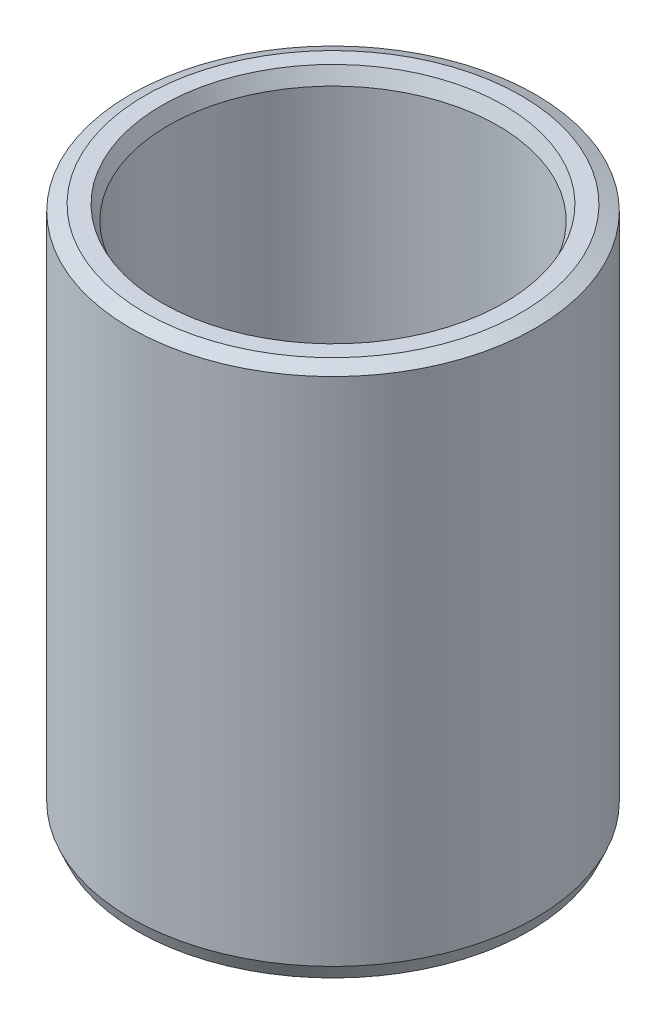
ISO-10303-21;
HEADER;
FILE_DESCRIPTION(('STEP AP214'),'2;1');
FILE_NAME('part.step','',(''),(''),'','','');
FILE_SCHEMA(('AUTOMOTIVE_DESIGN { 1 0 10303 214 1 1 1 1 }'));
ENDSEC;
DATA;
#1=APPLICATION_CONTEXT('core data for automotive mechanical design processes');
#2=APPLICATION_PROTOCOL_DEFINITION('international standard','automotive_design',2000,#1);
#3=PRODUCT_CONTEXT('',#1,'mechanical');
#4=PRODUCT('Part','Part','',(#3));
#5=PRODUCT_RELATED_PRODUCT_CATEGORY('part','',(#4));
#6=PRODUCT_DEFINITION_FORMATION('','',#4);
#7=PRODUCT_DEFINITION_CONTEXT('part definition',#1,'design');
#8=PRODUCT_DEFINITION('design','',#6,#7);
#9=PRODUCT_DEFINITION_SHAPE('','',#8);
#10=(LENGTH_UNIT() NAMED_UNIT(*) SI_UNIT(.MILLI.,.METRE.));
#11=(NAMED_UNIT(*) PLANE_ANGLE_UNIT() SI_UNIT($,.RADIAN.));
#12=(NAMED_UNIT(*) SI_UNIT($,.STERADIAN.) SOLID_ANGLE_UNIT());
#13=UNCERTAINTY_MEASURE_WITH_UNIT(LENGTH_MEASURE(1.E-05),#10,'distance_accuracy_value','');
#14=(GEOMETRIC_REPRESENTATION_CONTEXT(3) GLOBAL_UNCERTAINTY_ASSIGNED_CONTEXT((#13)) GLOBAL_UNIT_ASSIGNED_CONTEXT((#10,
#11,#12)) REPRESENTATION_CONTEXT('',''));
#15=CARTESIAN_POINT('',(0.,0.,0.));
#16=DIRECTION('',(0.,0.,1.));
#17=DIRECTION('',(1.,0.,0.));
#18=AXIS2_PLACEMENT_3D('',#15,#16,#17);
#19=CARTESIAN_POINT('',(0.,144.374591171393,0.));
#20=DIRECTION('',(0.,-1.,0.));
#21=DIRECTION('',(0.,0.,-1.));
#22=AXIS2_PLACEMENT_3D('',#19,#20,#21);
#23=CYLINDRICAL_SURFACE('',#22,55.);
#24=CARTESIAN_POINT('',(0.,3.9057126088804,0.));
#25=DIRECTION('',(0.,1.,0.));
#26=DIRECTION('',(0.,0.,1.));
#27=AXIS2_PLACEMENT_3D('',#24,#25,#26);
#28=CIRCLE('',#27,55.);
#29=CARTESIAN_POINT('',(0.,3.9057126088804,55.));
#30=VERTEX_POINT('',#29);
#31=EDGE_CURVE('E10',#30,#30,#28,.T.);
#32=ORIENTED_EDGE('',*,*,#31,.T.);
#33=EDGE_LOOP('',(#32));
#34=FACE_BOUND('',#33,.T.);
#35=CARTESIAN_POINT('',(0.,142.686396274811,0.));
#36=DIRECTION('',(0.,1.,0.));
#37=DIRECTION('',(0.,0.,1.));
#38=AXIS2_PLACEMENT_3D('',#35,#36,#37);
#39=CIRCLE('',#38,55.);
#40=CARTESIAN_POINT('',(0.,142.686396274811,55.));
#41=VERTEX_POINT('',#40);
#42=EDGE_CURVE('E50',#41,#41,#39,.F.);
#43=ORIENTED_EDGE('',*,*,#42,.T.);
#44=EDGE_LOOP('',(#43));
#45=FACE_BOUND('',#44,.T.);
#46=ADVANCED_FACE('F39',(#34,#45),#23,.T.);
#47=CARTESIAN_POINT('',(0.,144.374591171393,0.));
#48=DIRECTION('',(0.,1.,0.));
#49=DIRECTION('',(0.,0.,1.));
#50=AXIS2_PLACEMENT_3D('',#47,#48,#49);
#51=PLANE('',#50);
#52=CARTESIAN_POINT('',(0.,144.374591171393,0.));
#53=DIRECTION('',(0.,1.,0.));
#54=DIRECTION('',(0.,0.,1.));
#55=AXIS2_PLACEMENT_3D('',#52,#53,#54);
#56=CIRCLE('',#55,46.4873787624892);
#57=CARTESIAN_POINT('',(0.,144.374591171393,46.4873787624892));
#58=VERTEX_POINT('',#57);
#59=EDGE_CURVE('E58',#58,#58,#56,.F.);
#60=ORIENTED_EDGE('',*,*,#59,.T.);
#61=EDGE_LOOP('',(#60));
#62=FACE_BOUND('',#61,.T.);
#63=CARTESIAN_POINT('',(0.,144.374591171393,0.));
#64=DIRECTION('',(0.,1.,0.));
#65=DIRECTION('',(0.,0.,1.));
#66=AXIS2_PLACEMENT_3D('',#63,#64,#65);
#67=CIRCLE('',#66,51.0942873911195);
#68=CARTESIAN_POINT('',(0.,144.374591171393,51.0942873911195));
#69=VERTEX_POINT('',#68);
#70=EDGE_CURVE('E61',#69,#69,#67,.T.);
#71=ORIENTED_EDGE('',*,*,#70,.T.);
#72=EDGE_LOOP('',(#71));
#73=FACE_BOUND('',#72,.T.);
#74=ADVANCED_FACE('F88',(#62,#73),#51,.T.);
#75=CARTESIAN_POINT('',(0.,0.,0.));
#76=DIRECTION('',(0.,1.,0.));
#77=DIRECTION('',(0.,0.,1.));
#78=AXIS2_PLACEMENT_3D('',#75,#76,#77);
#79=PLANE('',#78);
#80=CARTESIAN_POINT('',(0.,0.,0.));
#81=DIRECTION('',(0.,1.,0.));
#82=DIRECTION('',(0.,0.,1.));
#83=AXIS2_PLACEMENT_3D('',#80,#81,#82);
#84=CIRCLE('',#83,48.7048964747872);
#85=CARTESIAN_POINT('',(0.,0.,48.7048964747872));
#86=VERTEX_POINT('',#85);
#87=EDGE_CURVE('E51',#86,#86,#84,.T.);
#88=ORIENTED_EDGE('',*,*,#87,.T.);
#89=EDGE_LOOP('',(#88));
#90=FACE_BOUND('',#89,.T.);
#91=CARTESIAN_POINT('',(0.,0.,0.));
#92=DIRECTION('',(0.,1.,0.));
#93=DIRECTION('',(0.,0.,1.));
#94=AXIS2_PLACEMENT_3D('',#91,#92,#93);
#95=CIRCLE('',#94,53.3118051034175);
#96=CARTESIAN_POINT('',(0.,0.,53.3118051034175));
#97=VERTEX_POINT('',#96);
#98=EDGE_CURVE('E54',#97,#97,#95,.F.);
#99=ORIENTED_EDGE('',*,*,#98,.T.);
#100=EDGE_LOOP('',(#99));
#101=FACE_BOUND('',#100,.T.);
#102=ADVANCED_FACE('F83',(#90,#101),#79,.F.);
#103=CARTESIAN_POINT('',(0.,144.374591171393,0.));
#104=DIRECTION('',(0.,-1.,0.));
#105=DIRECTION('',(0.,0.,-1.));
#106=AXIS2_PLACEMENT_3D('',#103,#104,#105);
#107=CYLINDRICAL_SURFACE('',#106,44.7991838659067);
#108=CARTESIAN_POINT('',(0.,140.468878562513,0.));
#109=DIRECTION('',(0.,1.,0.));
#110=DIRECTION('',(0.,0.,1.));
#111=AXIS2_PLACEMENT_3D('',#108,#109,#110);
#112=CIRCLE('',#111,44.7991838659067);
#113=CARTESIAN_POINT('',(0.,140.468878562513,44.7991838659067));
#114=VERTEX_POINT('',#113);
#115=EDGE_CURVE('E67',#114,#114,#112,.T.);
#116=ORIENTED_EDGE('',*,*,#115,.T.);
#117=EDGE_LOOP('',(#116));
#118=FACE_BOUND('',#117,.T.);
#119=CARTESIAN_POINT('',(0.,1.68819489658253,0.));
#120=DIRECTION('',(0.,1.,0.));
#121=DIRECTION('',(0.,0.,1.));
#122=AXIS2_PLACEMENT_3D('',#119,#120,#121);
#123=CIRCLE('',#122,44.7991838659067);
#124=CARTESIAN_POINT('',(0.,1.68819489658253,44.7991838659067));
#125=VERTEX_POINT('',#124);
#126=EDGE_CURVE('E69',#125,#125,#123,.F.);
#127=ORIENTED_EDGE('',*,*,#126,.T.);
#128=EDGE_LOOP('',(#127));
#129=FACE_BOUND('',#128,.T.);
#130=ADVANCED_FACE('F71',(#118,#129),#107,.F.);
#131=CARTESIAN_POINT('',(0.,140.468878562513,0.));
#132=DIRECTION('',(0.,1.,0.));
#133=DIRECTION('',(0.,0.,1.));
#134=AXIS2_PLACEMENT_3D('',#131,#132,#133);
#135=CONICAL_SURFACE('',#134,44.7991838659067,0.40798474881176);
#136=ORIENTED_EDGE('',*,*,#59,.F.);
#137=EDGE_LOOP('',(#136));
#138=FACE_BOUND('',#137,.T.);
#139=ORIENTED_EDGE('',*,*,#115,.F.);
#140=EDGE_LOOP('',(#139));
#141=FACE_BOUND('',#140,.T.);
#142=ADVANCED_FACE('F77',(#138,#141),#135,.F.);
#143=CARTESIAN_POINT('',(0.,0.,0.));
#144=DIRECTION('',(0.,-1.,0.));
#145=DIRECTION('',(0.,0.,-1.));
#146=AXIS2_PLACEMENT_3D('',#143,#144,#145);
#147=CONICAL_SURFACE('',#146,48.7048964747872,1.16281157798313);
#148=ORIENTED_EDGE('',*,*,#126,.F.);
#149=EDGE_LOOP('',(#148));
#150=FACE_BOUND('',#149,.T.);
#151=ORIENTED_EDGE('',*,*,#87,.F.);
#152=EDGE_LOOP('',(#151));
#153=FACE_BOUND('',#152,.T.);
#154=ADVANCED_FACE('F73',(#150,#153),#147,.F.);
#155=CARTESIAN_POINT('',(0.,3.9057126088804,0.));
#156=DIRECTION('',(0.,1.,0.));
#157=DIRECTION('',(0.,0.,1.));
#158=AXIS2_PLACEMENT_3D('',#155,#156,#157);
#159=CONICAL_SURFACE('',#158,55.,0.407984748811764);
#160=ORIENTED_EDGE('',*,*,#98,.F.);
#161=EDGE_LOOP('',(#160));
#162=FACE_BOUND('',#161,.T.);
#163=ORIENTED_EDGE('',*,*,#31,.F.);
#164=EDGE_LOOP('',(#163));
#165=FACE_BOUND('',#164,.T.);
#166=ADVANCED_FACE('F76',(#162,#165),#159,.T.);
#167=CARTESIAN_POINT('',(0.,144.374591171393,0.));
#168=DIRECTION('',(0.,-1.,0.));
#169=DIRECTION('',(0.,0.,-1.));
#170=AXIS2_PLACEMENT_3D('',#167,#168,#169);
#171=CONICAL_SURFACE('',#170,51.0942873911195,1.16281157798314);
#172=ORIENTED_EDGE('',*,*,#42,.F.);
#173=EDGE_LOOP('',(#172));
#174=FACE_BOUND('',#173,.T.);
#175=ORIENTED_EDGE('',*,*,#70,.F.);
#176=EDGE_LOOP('',(#175));
#177=FACE_BOUND('',#176,.T.);
#178=ADVANCED_FACE('F45',(#174,#177),#171,.T.);
#179=CLOSED_SHELL('',(#46,#74,#102,#130,#142,#154,#166,#178));
#180=MANIFOLD_SOLID_BREP('B2',#179);
#181=ADVANCED_BREP_SHAPE_REPRESENTATION('',(#18,#180),#14);
#182=SHAPE_DEFINITION_REPRESENTATION(#9,#181);
ENDSEC;
END-ISO-10303-21;
